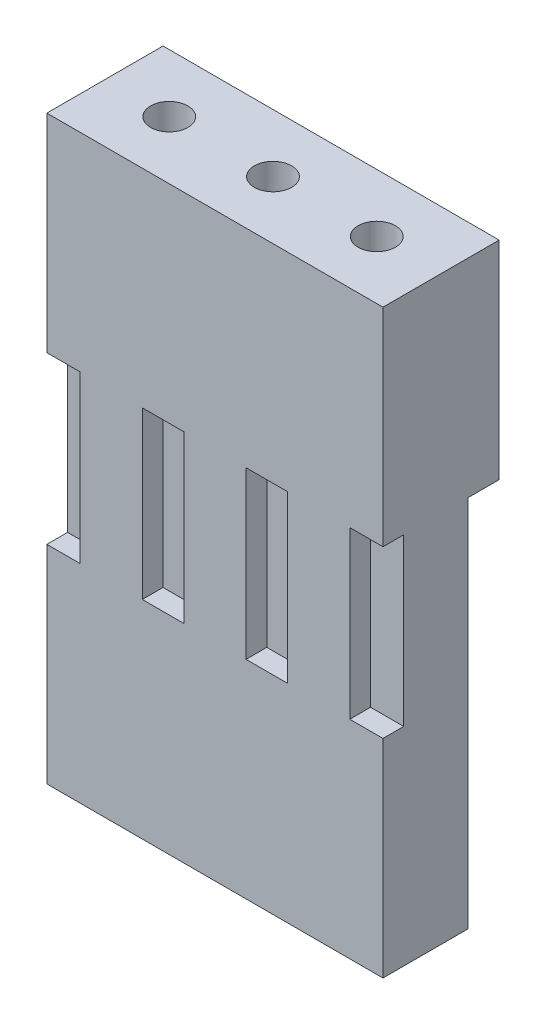
ISO-10303-21;
HEADER;
FILE_DESCRIPTION(('STEP AP214'),'2;1');
FILE_NAME('part.step','',(''),(''),'','','');
FILE_SCHEMA(('AUTOMOTIVE_DESIGN { 1 0 10303 214 1 1 1 1 }'));
ENDSEC;
DATA;
#1=APPLICATION_CONTEXT('core data for automotive mechanical design processes');
#2=APPLICATION_PROTOCOL_DEFINITION('international standard','automotive_design',2000,#1);
#3=PRODUCT_CONTEXT('',#1,'mechanical');
#4=PRODUCT('Part','Part','',(#3));
#5=PRODUCT_RELATED_PRODUCT_CATEGORY('part','',(#4));
#6=PRODUCT_DEFINITION_FORMATION('','',#4);
#7=PRODUCT_DEFINITION_CONTEXT('part definition',#1,'design');
#8=PRODUCT_DEFINITION('design','',#6,#7);
#9=PRODUCT_DEFINITION_SHAPE('','',#8);
#10=(LENGTH_UNIT() NAMED_UNIT(*) SI_UNIT(.MILLI.,.METRE.));
#11=(NAMED_UNIT(*) PLANE_ANGLE_UNIT() SI_UNIT($,.RADIAN.));
#12=(NAMED_UNIT(*) SI_UNIT($,.STERADIAN.) SOLID_ANGLE_UNIT());
#13=UNCERTAINTY_MEASURE_WITH_UNIT(LENGTH_MEASURE(1.E-05),#10,'distance_accuracy_value','');
#14=(GEOMETRIC_REPRESENTATION_CONTEXT(3) GLOBAL_UNCERTAINTY_ASSIGNED_CONTEXT((#13)) GLOBAL_UNIT_ASSIGNED_CONTEXT((#10,
#11,#12)) REPRESENTATION_CONTEXT('',''));
#15=CARTESIAN_POINT('',(0.,0.,0.));
#16=DIRECTION('',(0.,0.,1.));
#17=DIRECTION('',(1.,0.,0.));
#18=AXIS2_PLACEMENT_3D('',#15,#16,#17);
#19=CARTESIAN_POINT('',(0.,-5.,0.));
#20=DIRECTION('',(0.,1.,0.));
#21=DIRECTION('',(0.,0.,1.));
#22=AXIS2_PLACEMENT_3D('',#19,#20,#21);
#23=PLANE('',#22);
#24=DIRECTION('',(0.707106781186553,0.,0.707106781186542));
#25=VECTOR('',#24,1.);
#26=CARTESIAN_POINT('',(4.05,-5.,-0.650000000000012));
#27=LINE('',#26,#25);
#28=CARTESIAN_POINT('',(3.3,-5.,-1.4));
#29=VERTEX_POINT('',#28);
#30=CARTESIAN_POINT('',(4.05,-5.,-0.650000000000012));
#31=VERTEX_POINT('',#30);
#32=EDGE_CURVE('E320',#29,#31,#27,.T.);
#33=ORIENTED_EDGE('',*,*,#32,.F.);
#34=DIRECTION('',(-1.,0.,0.));
#35=VECTOR('',#34,1.);
#36=CARTESIAN_POINT('',(-4.05,-5.,-1.4));
#37=LINE('',#36,#35);
#38=CARTESIAN_POINT('',(4.05,-5.,-1.4));
#39=VERTEX_POINT('',#38);
#40=EDGE_CURVE('E731',#39,#29,#37,.T.);
#41=ORIENTED_EDGE('',*,*,#40,.F.);
#42=DIRECTION('',(0.,0.,-1.));
#43=VECTOR('',#42,1.);
#44=CARTESIAN_POINT('',(4.05,-5.,-1.4));
#45=LINE('',#44,#43);
#46=EDGE_CURVE('E340',#31,#39,#45,.T.);
#47=ORIENTED_EDGE('',*,*,#46,.F.);
#48=EDGE_LOOP('',(#33,#41,#47));
#49=FACE_BOUND('',#48,.T.);
#50=ADVANCED_FACE('F33',(#49),#23,.F.);
#51=DIRECTION('',(0.707106781186552,0.,-0.707106781186543));
#52=VECTOR('',#51,1.);
#53=CARTESIAN_POINT('',(-4.05,-5.,-0.65000000000001));
#54=LINE('',#53,#52);
#55=CARTESIAN_POINT('',(-4.05,-5.,-0.65000000000001));
#56=VERTEX_POINT('',#55);
#57=CARTESIAN_POINT('',(-3.3,-5.,-1.4));
#58=VERTEX_POINT('',#57);
#59=EDGE_CURVE('E315',#56,#58,#54,.T.);
#60=ORIENTED_EDGE('',*,*,#59,.F.);
#61=DIRECTION('',(0.,0.,1.));
#62=VECTOR('',#61,1.);
#63=CARTESIAN_POINT('',(-4.05,-5.,-1.4));
#64=LINE('',#63,#62);
#65=CARTESIAN_POINT('',(-4.05,-5.,-1.4));
#66=VERTEX_POINT('',#65);
#67=EDGE_CURVE('E724',#66,#56,#64,.T.);
#68=ORIENTED_EDGE('',*,*,#67,.F.);
#69=EDGE_CURVE('E733',#58,#66,#37,.T.);
#70=ORIENTED_EDGE('',*,*,#69,.F.);
#71=EDGE_LOOP('',(#60,#68,#70));
#72=FACE_BOUND('',#71,.T.);
#73=ADVANCED_FACE('F407',(#72),#23,.F.);
#74=CARTESIAN_POINT('',(-4.05,-5.,-1.4));
#75=DIRECTION('',(-1.,0.,0.));
#76=DIRECTION('',(0.,0.,1.));
#77=AXIS2_PLACEMENT_3D('',#74,#75,#76);
#78=PLANE('',#77);
#79=DIRECTION('',(0.,0.,-1.));
#80=VECTOR('',#79,1.);
#81=CARTESIAN_POINT('',(-4.05,-5.,-1.4));
#82=LINE('',#81,#80);
#83=CARTESIAN_POINT('',(-4.05,-5.,1.4));
#84=VERTEX_POINT('',#83);
#85=CARTESIAN_POINT('',(-4.05,-5.,0.9));
#86=VERTEX_POINT('',#85);
#87=EDGE_CURVE('E282',#84,#86,#82,.T.);
#88=ORIENTED_EDGE('',*,*,#87,.F.);
#89=DIRECTION('',(0.,1.,0.));
#90=VECTOR('',#89,1.);
#91=CARTESIAN_POINT('',(-4.05,-5.,1.4));
#92=LINE('',#91,#90);
#93=CARTESIAN_POINT('',(-4.05,0.,1.4));
#94=VERTEX_POINT('',#93);
#95=EDGE_CURVE('E386',#84,#94,#92,.T.);
#96=ORIENTED_EDGE('',*,*,#95,.T.);
#97=DIRECTION('',(0.,0.,1.));
#98=VECTOR('',#97,1.);
#99=CARTESIAN_POINT('',(-4.05,0.,-1.4));
#100=LINE('',#99,#98);
#101=CARTESIAN_POINT('',(-4.05,0.,-1.4));
#102=VERTEX_POINT('',#101);
#103=EDGE_CURVE('E711',#102,#94,#100,.T.);
#104=ORIENTED_EDGE('',*,*,#103,.F.);
#105=DIRECTION('',(0.,1.,0.));
#106=VECTOR('',#105,1.);
#107=CARTESIAN_POINT('',(-4.05,-5.,-1.4));
#108=LINE('',#107,#106);
#109=EDGE_CURVE('E368',#66,#102,#108,.T.);
#110=ORIENTED_EDGE('',*,*,#109,.F.);
#111=ORIENTED_EDGE('',*,*,#67,.T.);
#112=DIRECTION('',(0.,1.,0.));
#113=VECTOR('',#112,1.);
#114=CARTESIAN_POINT('',(-4.05,-14.,-0.65000000000001));
#115=LINE('',#114,#113);
#116=CARTESIAN_POINT('',(-4.05,-14.,-0.65000000000001));
#117=VERTEX_POINT('',#116);
#118=EDGE_CURVE('E346',#117,#56,#115,.T.);
#119=ORIENTED_EDGE('',*,*,#118,.F.);
#120=DIRECTION('',(0.,0.,-1.));
#121=VECTOR('',#120,1.);
#122=CARTESIAN_POINT('',(-4.05,-14.,1.4));
#123=LINE('',#122,#121);
#124=CARTESIAN_POINT('',(-4.05,-14.,1.4));
#125=VERTEX_POINT('',#124);
#126=EDGE_CURVE('E319',#125,#117,#123,.T.);
#127=ORIENTED_EDGE('',*,*,#126,.F.);
#128=CARTESIAN_POINT('',(-4.05,-9.,1.4));
#129=VERTEX_POINT('',#128);
#130=EDGE_CURVE('E729',#125,#129,#92,.T.);
#131=ORIENTED_EDGE('',*,*,#130,.T.);
#132=DIRECTION('',(0.,0.,1.));
#133=VECTOR('',#132,1.);
#134=CARTESIAN_POINT('',(-4.05,-9.,-1.4));
#135=LINE('',#134,#133);
#136=CARTESIAN_POINT('',(-4.05,-9.,0.9));
#137=VERTEX_POINT('',#136);
#138=EDGE_CURVE('E278',#137,#129,#135,.T.);
#139=ORIENTED_EDGE('',*,*,#138,.F.);
#140=DIRECTION('',(0.,1.,0.));
#141=VECTOR('',#140,1.);
#142=CARTESIAN_POINT('',(-4.05,-5.,0.9));
#143=LINE('',#142,#141);
#144=EDGE_CURVE('E11',#137,#86,#143,.T.);
#145=ORIENTED_EDGE('',*,*,#144,.T.);
#146=EDGE_LOOP('',(#88,#96,#104,#110,#111,#119,#127,#131,#139,#145));
#147=FACE_BOUND('',#146,.T.);
#148=ADVANCED_FACE('F35',(#147),#78,.T.);
#149=CARTESIAN_POINT('',(-4.05,-5.,-1.4));
#150=DIRECTION('',(0.,0.,-1.));
#151=DIRECTION('',(-1.,0.,0.));
#152=AXIS2_PLACEMENT_3D('',#149,#150,#151);
#153=PLANE('',#152);
#154=DIRECTION('',(-1.,0.,0.));
#155=VECTOR('',#154,1.);
#156=CARTESIAN_POINT('',(-4.05,0.,-1.4));
#157=LINE('',#156,#155);
#158=CARTESIAN_POINT('',(4.05,0.,-1.4));
#159=VERTEX_POINT('',#158);
#160=EDGE_CURVE('E728',#159,#102,#157,.T.);
#161=ORIENTED_EDGE('',*,*,#160,.F.);
#162=DIRECTION('',(0.,1.,0.));
#163=VECTOR('',#162,1.);
#164=CARTESIAN_POINT('',(4.05,-5.,-1.4));
#165=LINE('',#164,#163);
#166=EDGE_CURVE('E745',#39,#159,#165,.T.);
#167=ORIENTED_EDGE('',*,*,#166,.F.);
#168=ORIENTED_EDGE('',*,*,#40,.T.);
#169=DIRECTION('',(0.,1.,0.));
#170=VECTOR('',#169,1.);
#171=CARTESIAN_POINT('',(3.3,-14.,-1.4));
#172=LINE('',#171,#170);
#173=CARTESIAN_POINT('',(3.3,-14.,-1.4));
#174=VERTEX_POINT('',#173);
#175=EDGE_CURVE('E347',#174,#29,#172,.T.);
#176=ORIENTED_EDGE('',*,*,#175,.F.);
#177=DIRECTION('',(1.,0.,0.));
#178=VECTOR('',#177,1.);
#179=CARTESIAN_POINT('',(-3.3,-14.,-1.4));
#180=LINE('',#179,#178);
#181=CARTESIAN_POINT('',(-3.3,-14.,-1.4));
#182=VERTEX_POINT('',#181);
#183=EDGE_CURVE('E324',#182,#174,#180,.T.);
#184=ORIENTED_EDGE('',*,*,#183,.F.);
#185=DIRECTION('',(0.,1.,0.));
#186=VECTOR('',#185,1.);
#187=CARTESIAN_POINT('',(-3.3,-14.,-1.4));
#188=LINE('',#187,#186);
#189=EDGE_CURVE('E343',#182,#58,#188,.T.);
#190=ORIENTED_EDGE('',*,*,#189,.T.);
#191=ORIENTED_EDGE('',*,*,#69,.T.);
#192=ORIENTED_EDGE('',*,*,#109,.T.);
#193=EDGE_LOOP('',(#161,#167,#168,#176,#184,#190,#191,#192));
#194=FACE_BOUND('',#193,.T.);
#195=ADVANCED_FACE('F422',(#194),#153,.T.);
#196=CARTESIAN_POINT('',(4.05,-5.,-1.4));
#197=DIRECTION('',(1.,0.,0.));
#198=DIRECTION('',(0.,0.,-1.));
#199=AXIS2_PLACEMENT_3D('',#196,#197,#198);
#200=PLANE('',#199);
#201=DIRECTION('',(0.,0.,1.));
#202=VECTOR('',#201,1.);
#203=CARTESIAN_POINT('',(4.05,-5.,-1.4));
#204=LINE('',#203,#202);
#205=CARTESIAN_POINT('',(4.05,-5.,0.9));
#206=VERTEX_POINT('',#205);
#207=CARTESIAN_POINT('',(4.05,-5.,1.4));
#208=VERTEX_POINT('',#207);
#209=EDGE_CURVE('E304',#206,#208,#204,.T.);
#210=ORIENTED_EDGE('',*,*,#209,.F.);
#211=DIRECTION('',(0.,-1.,0.));
#212=VECTOR('',#211,1.);
#213=CARTESIAN_POINT('',(4.05,-5.,0.9));
#214=LINE('',#213,#212);
#215=CARTESIAN_POINT('',(4.05,-9.,0.9));
#216=VERTEX_POINT('',#215);
#217=EDGE_CURVE('E367',#206,#216,#214,.T.);
#218=ORIENTED_EDGE('',*,*,#217,.T.);
#219=DIRECTION('',(0.,0.,-1.));
#220=VECTOR('',#219,1.);
#221=CARTESIAN_POINT('',(4.05,-9.,-1.4));
#222=LINE('',#221,#220);
#223=CARTESIAN_POINT('',(4.05,-9.,1.4));
#224=VERTEX_POINT('',#223);
#225=EDGE_CURVE('E300',#224,#216,#222,.T.);
#226=ORIENTED_EDGE('',*,*,#225,.F.);
#227=DIRECTION('',(0.,1.,0.));
#228=VECTOR('',#227,1.);
#229=CARTESIAN_POINT('',(4.05,-5.,1.4));
#230=LINE('',#229,#228);
#231=CARTESIAN_POINT('',(4.05,-14.,1.4));
#232=VERTEX_POINT('',#231);
#233=EDGE_CURVE('E746',#232,#224,#230,.T.);
#234=ORIENTED_EDGE('',*,*,#233,.F.);
#235=DIRECTION('',(0.,0.,1.));
#236=VECTOR('',#235,1.);
#237=CARTESIAN_POINT('',(4.05,-14.,-0.650000000000012));
#238=LINE('',#237,#236);
#239=CARTESIAN_POINT('',(4.05,-14.,-0.650000000000012));
#240=VERTEX_POINT('',#239);
#241=EDGE_CURVE('E328',#240,#232,#238,.T.);
#242=ORIENTED_EDGE('',*,*,#241,.F.);
#243=DIRECTION('',(0.,1.,0.));
#244=VECTOR('',#243,1.);
#245=CARTESIAN_POINT('',(4.05,-14.,-0.650000000000012));
#246=LINE('',#245,#244);
#247=EDGE_CURVE('E331',#240,#31,#246,.T.);
#248=ORIENTED_EDGE('',*,*,#247,.T.);
#249=ORIENTED_EDGE('',*,*,#46,.T.);
#250=ORIENTED_EDGE('',*,*,#166,.T.);
#251=DIRECTION('',(0.,0.,-1.));
#252=VECTOR('',#251,1.);
#253=CARTESIAN_POINT('',(4.05,0.,-1.4));
#254=LINE('',#253,#252);
#255=CARTESIAN_POINT('',(4.05,0.,1.4));
#256=VERTEX_POINT('',#255);
#257=EDGE_CURVE('E739',#256,#159,#254,.T.);
#258=ORIENTED_EDGE('',*,*,#257,.F.);
#259=EDGE_CURVE('E748',#208,#256,#230,.T.);
#260=ORIENTED_EDGE('',*,*,#259,.F.);
#261=EDGE_LOOP('',(#210,#218,#226,#234,#242,#248,#249,#250,#258,#260));
#262=FACE_BOUND('',#261,.T.);
#263=ADVANCED_FACE('F425',(#262),#200,.T.);
#264=CARTESIAN_POINT('',(-4.05,-5.,1.4));
#265=DIRECTION('',(0.,0.,1.));
#266=DIRECTION('',(1.,0.,0.));
#267=AXIS2_PLACEMENT_3D('',#264,#265,#266);
#268=PLANE('',#267);
#269=DIRECTION('',(-1.,0.,0.));
#270=VECTOR('',#269,1.);
#271=CARTESIAN_POINT('',(-0.749999999999999,-5.,1.4));
#272=LINE('',#271,#270);
#273=CARTESIAN_POINT('',(-0.749999999999999,-5.,1.4));
#274=VERTEX_POINT('',#273);
#275=CARTESIAN_POINT('',(-1.75,-5.,1.4));
#276=VERTEX_POINT('',#275);
#277=EDGE_CURVE('E48',#274,#276,#272,.T.);
#278=ORIENTED_EDGE('',*,*,#277,.F.);
#279=DIRECTION('',(0.,1.,0.));
#280=VECTOR('',#279,1.);
#281=CARTESIAN_POINT('',(-0.749999999999999,-5.,1.4));
#282=LINE('',#281,#280);
#283=CARTESIAN_POINT('',(-0.749999999999999,-9.,1.4));
#284=VERTEX_POINT('',#283);
#285=EDGE_CURVE('E214',#284,#274,#282,.T.);
#286=ORIENTED_EDGE('',*,*,#285,.F.);
#287=DIRECTION('',(1.,0.,0.));
#288=VECTOR('',#287,1.);
#289=CARTESIAN_POINT('',(-0.749999999999999,-9.,1.4));
#290=LINE('',#289,#288);
#291=CARTESIAN_POINT('',(-1.75,-9.,1.4));
#292=VERTEX_POINT('',#291);
#293=EDGE_CURVE('E217',#292,#284,#290,.T.);
#294=ORIENTED_EDGE('',*,*,#293,.F.);
#295=DIRECTION('',(0.,-1.,0.));
#296=VECTOR('',#295,1.);
#297=CARTESIAN_POINT('',(-1.75,-5.,1.4));
#298=LINE('',#297,#296);
#299=EDGE_CURVE('E223',#276,#292,#298,.T.);
#300=ORIENTED_EDGE('',*,*,#299,.F.);
#301=EDGE_LOOP('',(#278,#286,#294,#300));
#302=FACE_BOUND('',#301,.T.);
#303=DIRECTION('',(0.,-1.,0.));
#304=VECTOR('',#303,1.);
#305=CARTESIAN_POINT('',(0.750000000000001,-5.,1.4));
#306=LINE('',#305,#304);
#307=CARTESIAN_POINT('',(0.750000000000001,-5.,1.4));
#308=VERTEX_POINT('',#307);
#309=CARTESIAN_POINT('',(0.750000000000001,-9.,1.4));
#310=VERTEX_POINT('',#309);
#311=EDGE_CURVE('E56',#308,#310,#306,.T.);
#312=ORIENTED_EDGE('',*,*,#311,.F.);
#313=DIRECTION('',(-1.,0.,0.));
#314=VECTOR('',#313,1.);
#315=CARTESIAN_POINT('',(0.750000000000001,-5.,1.4));
#316=LINE('',#315,#314);
#317=CARTESIAN_POINT('',(1.75,-5.,1.4));
#318=VERTEX_POINT('',#317);
#319=EDGE_CURVE('E236',#318,#308,#316,.T.);
#320=ORIENTED_EDGE('',*,*,#319,.F.);
#321=DIRECTION('',(0.,1.,0.));
#322=VECTOR('',#321,1.);
#323=CARTESIAN_POINT('',(1.75,-5.,1.4));
#324=LINE('',#323,#322);
#325=CARTESIAN_POINT('',(1.75,-9.,1.4));
#326=VERTEX_POINT('',#325);
#327=EDGE_CURVE('E250',#326,#318,#324,.T.);
#328=ORIENTED_EDGE('',*,*,#327,.F.);
#329=DIRECTION('',(1.,0.,0.));
#330=VECTOR('',#329,1.);
#331=CARTESIAN_POINT('',(0.750000000000001,-9.,1.4));
#332=LINE('',#331,#330);
#333=EDGE_CURVE('E247',#310,#326,#332,.T.);
#334=ORIENTED_EDGE('',*,*,#333,.F.);
#335=EDGE_LOOP('',(#312,#320,#328,#334));
#336=FACE_BOUND('',#335,.T.);
#337=DIRECTION('',(-1.,0.,0.));
#338=VECTOR('',#337,1.);
#339=CARTESIAN_POINT('',(-3.25,-5.,1.4));
#340=LINE('',#339,#338);
#341=CARTESIAN_POINT('',(-3.25,-5.,1.4));
#342=VERTEX_POINT('',#341);
#343=EDGE_CURVE('E257',#342,#84,#340,.T.);
#344=ORIENTED_EDGE('',*,*,#343,.F.);
#345=DIRECTION('',(0.,1.,0.));
#346=VECTOR('',#345,1.);
#347=CARTESIAN_POINT('',(-3.25,-5.,1.4));
#348=LINE('',#347,#346);
#349=CARTESIAN_POINT('',(-3.25,-9.,1.4));
#350=VERTEX_POINT('',#349);
#351=EDGE_CURVE('E267',#350,#342,#348,.T.);
#352=ORIENTED_EDGE('',*,*,#351,.F.);
#353=DIRECTION('',(1.,0.,0.));
#354=VECTOR('',#353,1.);
#355=CARTESIAN_POINT('',(-4.04999999999999,-9.,1.4));
#356=LINE('',#355,#354);
#357=EDGE_CURVE('E41',#129,#350,#356,.T.);
#358=ORIENTED_EDGE('',*,*,#357,.F.);
#359=ORIENTED_EDGE('',*,*,#130,.F.);
#360=DIRECTION('',(-1.,0.,0.));
#361=VECTOR('',#360,1.);
#362=CARTESIAN_POINT('',(4.05,-14.,1.4));
#363=LINE('',#362,#361);
#364=EDGE_CURVE('E316',#232,#125,#363,.T.);
#365=ORIENTED_EDGE('',*,*,#364,.F.);
#366=ORIENTED_EDGE('',*,*,#233,.T.);
#367=DIRECTION('',(1.,0.,0.));
#368=VECTOR('',#367,1.);
#369=CARTESIAN_POINT('',(3.25,-9.,1.4));
#370=LINE('',#369,#368);
#371=CARTESIAN_POINT('',(3.25,-9.,1.4));
#372=VERTEX_POINT('',#371);
#373=EDGE_CURVE('E289',#372,#224,#370,.T.);
#374=ORIENTED_EDGE('',*,*,#373,.F.);
#375=DIRECTION('',(0.,-1.,0.));
#376=VECTOR('',#375,1.);
#377=CARTESIAN_POINT('',(3.25,-5.,1.4));
#378=LINE('',#377,#376);
#379=CARTESIAN_POINT('',(3.25,-5.,1.4));
#380=VERTEX_POINT('',#379);
#381=EDGE_CURVE('E284',#380,#372,#378,.T.);
#382=ORIENTED_EDGE('',*,*,#381,.F.);
#383=DIRECTION('',(-1.,0.,0.));
#384=VECTOR('',#383,1.);
#385=CARTESIAN_POINT('',(-4.05,-5.00000000000001,1.4));
#386=LINE('',#385,#384);
#387=EDGE_CURVE('E365',#208,#380,#386,.T.);
#388=ORIENTED_EDGE('',*,*,#387,.F.);
#389=ORIENTED_EDGE('',*,*,#259,.T.);
#390=DIRECTION('',(1.,0.,0.));
#391=VECTOR('',#390,1.);
#392=CARTESIAN_POINT('',(-4.05,0.,1.4));
#393=LINE('',#392,#391);
#394=EDGE_CURVE('E715',#94,#256,#393,.T.);
#395=ORIENTED_EDGE('',*,*,#394,.F.);
#396=ORIENTED_EDGE('',*,*,#95,.F.);
#397=EDGE_LOOP('',(#344,#352,#358,#359,#365,#366,#374,#382,#388,#389,#395,#396));
#398=FACE_BOUND('',#397,.T.);
#399=ADVANCED_FACE('F383',(#302,#336,#398),#268,.T.);
#400=CARTESIAN_POINT('',(0.,0.,0.));
#401=DIRECTION('',(0.,1.,0.));
#402=DIRECTION('',(0.,0.,1.));
#403=AXIS2_PLACEMENT_3D('',#400,#401,#402);
#404=PLANE('',#403);
#405=CARTESIAN_POINT('',(-2.5,0.,0.));
#406=DIRECTION('',(0.,1.,0.));
#407=DIRECTION('',(0.,0.,-1.));
#408=AXIS2_PLACEMENT_3D('',#405,#406,#407);
#409=CIRCLE('',#408,0.45);
#410=CARTESIAN_POINT('',(-2.5,0.,-0.45));
#411=VERTEX_POINT('',#410);
#412=EDGE_CURVE('E352',#411,#411,#409,.T.);
#413=ORIENTED_EDGE('',*,*,#412,.F.);
#414=EDGE_LOOP('',(#413));
#415=FACE_BOUND('',#414,.T.);
#416=CARTESIAN_POINT('',(0.,0.,0.));
#417=DIRECTION('',(0.,1.,0.));
#418=DIRECTION('',(0.,0.,1.));
#419=AXIS2_PLACEMENT_3D('',#416,#417,#418);
#420=CIRCLE('',#419,0.45);
#421=CARTESIAN_POINT('',(0.,0.,0.45));
#422=VERTEX_POINT('',#421);
#423=EDGE_CURVE('E712',#422,#422,#420,.T.);
#424=ORIENTED_EDGE('',*,*,#423,.F.);
#425=EDGE_LOOP('',(#424));
#426=FACE_BOUND('',#425,.T.);
#427=CARTESIAN_POINT('',(2.5,0.,0.));
#428=DIRECTION('',(0.,1.,0.));
#429=DIRECTION('',(0.,0.,1.));
#430=AXIS2_PLACEMENT_3D('',#427,#428,#429);
#431=CIRCLE('',#430,0.45);
#432=CARTESIAN_POINT('',(2.5,0.,0.45));
#433=VERTEX_POINT('',#432);
#434=EDGE_CURVE('E704',#433,#433,#431,.T.);
#435=ORIENTED_EDGE('',*,*,#434,.F.);
#436=EDGE_LOOP('',(#435));
#437=FACE_BOUND('',#436,.T.);
#438=ORIENTED_EDGE('',*,*,#103,.T.);
#439=ORIENTED_EDGE('',*,*,#394,.T.);
#440=ORIENTED_EDGE('',*,*,#257,.T.);
#441=ORIENTED_EDGE('',*,*,#160,.T.);
#442=EDGE_LOOP('',(#438,#439,#440,#441));
#443=FACE_BOUND('',#442,.T.);
#444=ADVANCED_FACE('F418',(#415,#426,#437,#443),#404,.T.);
#445=CARTESIAN_POINT('',(2.5,-5.,0.));
#446=DIRECTION('',(0.,1.,0.));
#447=DIRECTION('',(0.,0.,1.));
#448=AXIS2_PLACEMENT_3D('',#445,#446,#447);
#449=CYLINDRICAL_SURFACE('',#448,0.45);
#450=ORIENTED_EDGE('',*,*,#434,.T.);
#451=EDGE_LOOP('',(#450));
#452=FACE_BOUND('',#451,.T.);
#453=CARTESIAN_POINT('',(2.5,-14.,0.));
#454=DIRECTION('',(0.,-1.,0.));
#455=DIRECTION('',(0.,0.,-1.));
#456=AXIS2_PLACEMENT_3D('',#453,#454,#455);
#457=CIRCLE('',#456,0.45);
#458=CARTESIAN_POINT('',(2.5,-14.,-0.45));
#459=VERTEX_POINT('',#458);
#460=EDGE_CURVE('E312',#459,#459,#457,.T.);
#461=ORIENTED_EDGE('',*,*,#460,.T.);
#462=EDGE_LOOP('',(#461));
#463=FACE_BOUND('',#462,.T.);
#464=ADVANCED_FACE('F416',(#452,#463),#449,.F.);
#465=CARTESIAN_POINT('',(0.,-5.,0.));
#466=DIRECTION('',(0.,1.,0.));
#467=DIRECTION('',(0.,0.,1.));
#468=AXIS2_PLACEMENT_3D('',#465,#466,#467);
#469=CYLINDRICAL_SURFACE('',#468,0.45);
#470=ORIENTED_EDGE('',*,*,#423,.T.);
#471=EDGE_LOOP('',(#470));
#472=FACE_BOUND('',#471,.T.);
#473=CARTESIAN_POINT('',(0.,-14.,0.));
#474=DIRECTION('',(0.,-1.,0.));
#475=DIRECTION('',(0.,0.,-1.));
#476=AXIS2_PLACEMENT_3D('',#473,#474,#475);
#477=CIRCLE('',#476,0.45);
#478=CARTESIAN_POINT('',(0.,-14.,-0.45));
#479=VERTEX_POINT('',#478);
#480=EDGE_CURVE('E309',#479,#479,#477,.T.);
#481=ORIENTED_EDGE('',*,*,#480,.T.);
#482=EDGE_LOOP('',(#481));
#483=FACE_BOUND('',#482,.T.);
#484=ADVANCED_FACE('F643',(#472,#483),#469,.F.);
#485=CARTESIAN_POINT('',(-2.5,-5.,0.));
#486=DIRECTION('',(0.,1.,0.));
#487=DIRECTION('',(0.,0.,1.));
#488=AXIS2_PLACEMENT_3D('',#485,#486,#487);
#489=CYLINDRICAL_SURFACE('',#488,0.45);
#490=ORIENTED_EDGE('',*,*,#412,.T.);
#491=EDGE_LOOP('',(#490));
#492=FACE_BOUND('',#491,.T.);
#493=CARTESIAN_POINT('',(-2.5,-14.,0.));
#494=DIRECTION('',(0.,-1.,0.));
#495=DIRECTION('',(0.,0.,-1.));
#496=AXIS2_PLACEMENT_3D('',#493,#494,#495);
#497=CIRCLE('',#496,0.45);
#498=CARTESIAN_POINT('',(-2.5,-14.,-0.45));
#499=VERTEX_POINT('',#498);
#500=EDGE_CURVE('E306',#499,#499,#497,.T.);
#501=ORIENTED_EDGE('',*,*,#500,.T.);
#502=EDGE_LOOP('',(#501));
#503=FACE_BOUND('',#502,.T.);
#504=ADVANCED_FACE('F633',(#492,#503),#489,.F.);
#505=CARTESIAN_POINT('',(0.,-14.,0.));
#506=DIRECTION('',(0.,-1.,0.));
#507=DIRECTION('',(0.,0.,-1.));
#508=AXIS2_PLACEMENT_3D('',#505,#506,#507);
#509=PLANE('',#508);
#510=ORIENTED_EDGE('',*,*,#480,.F.);
#511=EDGE_LOOP('',(#510));
#512=FACE_BOUND('',#511,.T.);
#513=ORIENTED_EDGE('',*,*,#364,.T.);
#514=ORIENTED_EDGE('',*,*,#126,.T.);
#515=DIRECTION('',(0.707106781186552,0.,-0.707106781186543));
#516=VECTOR('',#515,1.);
#517=CARTESIAN_POINT('',(-4.05,-14.,-0.65000000000001));
#518=LINE('',#517,#516);
#519=EDGE_CURVE('E322',#117,#182,#518,.T.);
#520=ORIENTED_EDGE('',*,*,#519,.T.);
#521=ORIENTED_EDGE('',*,*,#183,.T.);
#522=DIRECTION('',(0.707106781186553,0.,0.707106781186542));
#523=VECTOR('',#522,1.);
#524=CARTESIAN_POINT('',(4.05,-14.,-0.650000000000012));
#525=LINE('',#524,#523);
#526=EDGE_CURVE('E326',#174,#240,#525,.T.);
#527=ORIENTED_EDGE('',*,*,#526,.T.);
#528=ORIENTED_EDGE('',*,*,#241,.T.);
#529=EDGE_LOOP('',(#513,#514,#520,#521,#527,#528));
#530=FACE_BOUND('',#529,.T.);
#531=ORIENTED_EDGE('',*,*,#460,.F.);
#532=EDGE_LOOP('',(#531));
#533=FACE_BOUND('',#532,.T.);
#534=ORIENTED_EDGE('',*,*,#500,.F.);
#535=EDGE_LOOP('',(#534));
#536=FACE_BOUND('',#535,.T.);
#537=ADVANCED_FACE('F623',(#512,#530,#533,#536),#509,.T.);
#538=CARTESIAN_POINT('',(-4.05,-14.,-0.65000000000001));
#539=DIRECTION('',(0.707106781186543,0.,0.707106781186552));
#540=DIRECTION('',(0.707106781186552,0.,-0.707106781186543));
#541=AXIS2_PLACEMENT_3D('',#538,#539,#540);
#542=PLANE('',#541);
#543=ORIENTED_EDGE('',*,*,#59,.T.);
#544=ORIENTED_EDGE('',*,*,#189,.F.);
#545=ORIENTED_EDGE('',*,*,#519,.F.);
#546=ORIENTED_EDGE('',*,*,#118,.T.);
#547=EDGE_LOOP('',(#543,#544,#545,#546));
#548=FACE_BOUND('',#547,.T.);
#549=ADVANCED_FACE('F613',(#548),#542,.F.);
#550=CARTESIAN_POINT('',(4.05,-14.,-0.650000000000012));
#551=DIRECTION('',(-0.707106781186542,0.,0.707106781186553));
#552=DIRECTION('',(0.707106781186553,0.,0.707106781186542));
#553=AXIS2_PLACEMENT_3D('',#550,#551,#552);
#554=PLANE('',#553);
#555=ORIENTED_EDGE('',*,*,#32,.T.);
#556=ORIENTED_EDGE('',*,*,#247,.F.);
#557=ORIENTED_EDGE('',*,*,#526,.F.);
#558=ORIENTED_EDGE('',*,*,#175,.T.);
#559=EDGE_LOOP('',(#555,#556,#557,#558));
#560=FACE_BOUND('',#559,.T.);
#561=ADVANCED_FACE('F579',(#560),#554,.F.);
#562=CARTESIAN_POINT('',(3.25,-5.,0.9));
#563=DIRECTION('',(-1.,0.,0.));
#564=DIRECTION('',(0.,-1.,0.));
#565=AXIS2_PLACEMENT_3D('',#562,#563,#564);
#566=PLANE('',#565);
#567=ORIENTED_EDGE('',*,*,#381,.T.);
#568=DIRECTION('',(0.,0.,1.));
#569=VECTOR('',#568,1.);
#570=CARTESIAN_POINT('',(3.25,-9.,0.9));
#571=LINE('',#570,#569);
#572=CARTESIAN_POINT('',(3.25,-9.,0.9));
#573=VERTEX_POINT('',#572);
#574=EDGE_CURVE('E294',#573,#372,#571,.T.);
#575=ORIENTED_EDGE('',*,*,#574,.F.);
#576=DIRECTION('',(0.,-1.,0.));
#577=VECTOR('',#576,1.);
#578=CARTESIAN_POINT('',(3.25,-5.,0.9));
#579=LINE('',#578,#577);
#580=CARTESIAN_POINT('',(3.25,-5.,0.9));
#581=VERTEX_POINT('',#580);
#582=EDGE_CURVE('E285',#581,#573,#579,.T.);
#583=ORIENTED_EDGE('',*,*,#582,.F.);
#584=DIRECTION('',(0.,0.,1.));
#585=VECTOR('',#584,1.);
#586=CARTESIAN_POINT('',(3.25,-5.,0.9));
#587=LINE('',#586,#585);
#588=EDGE_CURVE('E297',#581,#380,#587,.T.);
#589=ORIENTED_EDGE('',*,*,#588,.T.);
#590=EDGE_LOOP('',(#567,#575,#583,#589));
#591=FACE_BOUND('',#590,.T.);
#592=ADVANCED_FACE('F570',(#591),#566,.F.);
#593=CARTESIAN_POINT('',(3.25,-5.,0.9));
#594=DIRECTION('',(0.,1.,0.));
#595=DIRECTION('',(-1.,0.,0.));
#596=AXIS2_PLACEMENT_3D('',#593,#594,#595);
#597=PLANE('',#596);
#598=ORIENTED_EDGE('',*,*,#209,.T.);
#599=ORIENTED_EDGE('',*,*,#387,.T.);
#600=ORIENTED_EDGE('',*,*,#588,.F.);
#601=DIRECTION('',(-1.,0.,0.));
#602=VECTOR('',#601,1.);
#603=CARTESIAN_POINT('',(3.25,-5.,0.9));
#604=LINE('',#603,#602);
#605=EDGE_CURVE('E292',#206,#581,#604,.T.);
#606=ORIENTED_EDGE('',*,*,#605,.F.);
#607=EDGE_LOOP('',(#598,#599,#600,#606));
#608=FACE_BOUND('',#607,.T.);
#609=ADVANCED_FACE('F560',(#608),#597,.F.);
#610=CARTESIAN_POINT('',(3.25,-9.,0.9));
#611=DIRECTION('',(0.,-1.,0.));
#612=DIRECTION('',(0.,0.,-1.));
#613=AXIS2_PLACEMENT_3D('',#610,#611,#612);
#614=PLANE('',#613);
#615=ORIENTED_EDGE('',*,*,#225,.T.);
#616=DIRECTION('',(1.,0.,0.));
#617=VECTOR('',#616,1.);
#618=CARTESIAN_POINT('',(3.25,-9.,0.9));
#619=LINE('',#618,#617);
#620=EDGE_CURVE('E288',#573,#216,#619,.T.);
#621=ORIENTED_EDGE('',*,*,#620,.F.);
#622=ORIENTED_EDGE('',*,*,#574,.T.);
#623=ORIENTED_EDGE('',*,*,#373,.T.);
#624=EDGE_LOOP('',(#615,#621,#622,#623));
#625=FACE_BOUND('',#624,.T.);
#626=ADVANCED_FACE('F550',(#625),#614,.F.);
#627=CARTESIAN_POINT('',(0.,0.,0.9));
#628=DIRECTION('',(0.,0.,1.));
#629=DIRECTION('',(1.,0.,0.));
#630=AXIS2_PLACEMENT_3D('',#627,#628,#629);
#631=PLANE('',#630);
#632=ORIENTED_EDGE('',*,*,#605,.T.);
#633=ORIENTED_EDGE('',*,*,#582,.T.);
#634=ORIENTED_EDGE('',*,*,#620,.T.);
#635=ORIENTED_EDGE('',*,*,#217,.F.);
#636=EDGE_LOOP('',(#632,#633,#634,#635));
#637=FACE_BOUND('',#636,.T.);
#638=ADVANCED_FACE('F541',(#637),#631,.T.);
#639=CARTESIAN_POINT('',(-3.25,-5.,0.9));
#640=DIRECTION('',(0.,1.,0.));
#641=DIRECTION('',(-1.,0.,0.));
#642=AXIS2_PLACEMENT_3D('',#639,#640,#641);
#643=PLANE('',#642);
#644=ORIENTED_EDGE('',*,*,#87,.T.);
#645=DIRECTION('',(-1.,0.,0.));
#646=VECTOR('',#645,1.);
#647=CARTESIAN_POINT('',(-3.25,-5.,0.9));
#648=LINE('',#647,#646);
#649=CARTESIAN_POINT('',(-3.25,-5.,0.9));
#650=VERTEX_POINT('',#649);
#651=EDGE_CURVE('E263',#650,#86,#648,.T.);
#652=ORIENTED_EDGE('',*,*,#651,.F.);
#653=DIRECTION('',(0.,0.,1.));
#654=VECTOR('',#653,1.);
#655=CARTESIAN_POINT('',(-3.25,-5.,0.9));
#656=LINE('',#655,#654);
#657=EDGE_CURVE('E276',#650,#342,#656,.T.);
#658=ORIENTED_EDGE('',*,*,#657,.T.);
#659=ORIENTED_EDGE('',*,*,#343,.T.);
#660=EDGE_LOOP('',(#644,#652,#658,#659));
#661=FACE_BOUND('',#660,.T.);
#662=ADVANCED_FACE('F389',(#661),#643,.F.);
#663=CARTESIAN_POINT('',(-3.25,-5.,0.9));
#664=DIRECTION('',(1.,0.,0.));
#665=DIRECTION('',(0.,1.,0.));
#666=AXIS2_PLACEMENT_3D('',#663,#664,#665);
#667=PLANE('',#666);
#668=ORIENTED_EDGE('',*,*,#351,.T.);
#669=ORIENTED_EDGE('',*,*,#657,.F.);
#670=DIRECTION('',(0.,1.,0.));
#671=VECTOR('',#670,1.);
#672=CARTESIAN_POINT('',(-3.25,-5.,0.9));
#673=LINE('',#672,#671);
#674=CARTESIAN_POINT('',(-3.25,-9.,0.9));
#675=VERTEX_POINT('',#674);
#676=EDGE_CURVE('E269',#675,#650,#673,.T.);
#677=ORIENTED_EDGE('',*,*,#676,.F.);
#678=DIRECTION('',(0.,0.,1.));
#679=VECTOR('',#678,1.);
#680=CARTESIAN_POINT('',(-3.25,-9.,0.9));
#681=LINE('',#680,#679);
#682=EDGE_CURVE('E272',#675,#350,#681,.T.);
#683=ORIENTED_EDGE('',*,*,#682,.T.);
#684=EDGE_LOOP('',(#668,#669,#677,#683));
#685=FACE_BOUND('',#684,.T.);
#686=ADVANCED_FACE('F381',(#685),#667,.F.);
#687=CARTESIAN_POINT('',(-3.25,-9.,0.9));
#688=DIRECTION('',(0.,-1.,0.));
#689=DIRECTION('',(1.,0.,0.));
#690=AXIS2_PLACEMENT_3D('',#687,#688,#689);
#691=PLANE('',#690);
#692=ORIENTED_EDGE('',*,*,#138,.T.);
#693=ORIENTED_EDGE('',*,*,#357,.T.);
#694=ORIENTED_EDGE('',*,*,#682,.F.);
#695=DIRECTION('',(1.,0.,0.));
#696=VECTOR('',#695,1.);
#697=CARTESIAN_POINT('',(-3.25,-9.,0.9));
#698=LINE('',#697,#696);
#699=EDGE_CURVE('E266',#137,#675,#698,.T.);
#700=ORIENTED_EDGE('',*,*,#699,.F.);
#701=EDGE_LOOP('',(#692,#693,#694,#700));
#702=FACE_BOUND('',#701,.T.);
#703=ADVANCED_FACE('F373',(#702),#691,.F.);
#704=CARTESIAN_POINT('',(0.,0.,0.9));
#705=DIRECTION('',(0.,0.,1.));
#706=DIRECTION('',(1.,0.,0.));
#707=AXIS2_PLACEMENT_3D('',#704,#705,#706);
#708=PLANE('',#707);
#709=ORIENTED_EDGE('',*,*,#699,.T.);
#710=ORIENTED_EDGE('',*,*,#676,.T.);
#711=ORIENTED_EDGE('',*,*,#651,.T.);
#712=ORIENTED_EDGE('',*,*,#144,.F.);
#713=EDGE_LOOP('',(#709,#710,#711,#712));
#714=FACE_BOUND('',#713,.T.);
#715=ADVANCED_FACE('F394',(#714),#708,.T.);
#716=CARTESIAN_POINT('',(0.750000000000001,-5.,0.9));
#717=DIRECTION('',(-1.,0.,0.));
#718=DIRECTION('',(0.,-1.,0.));
#719=AXIS2_PLACEMENT_3D('',#716,#717,#718);
#720=PLANE('',#719);
#721=ORIENTED_EDGE('',*,*,#311,.T.);
#722=DIRECTION('',(0.,0.,1.));
#723=VECTOR('',#722,1.);
#724=CARTESIAN_POINT('',(0.750000000000001,-9.,0.9));
#725=LINE('',#724,#723);
#726=CARTESIAN_POINT('',(0.750000000000001,-9.,0.9));
#727=VERTEX_POINT('',#726);
#728=EDGE_CURVE('E245',#727,#310,#725,.T.);
#729=ORIENTED_EDGE('',*,*,#728,.F.);
#730=DIRECTION('',(0.,-1.,0.));
#731=VECTOR('',#730,1.);
#732=CARTESIAN_POINT('',(0.750000000000001,-5.,0.9));
#733=LINE('',#732,#731);
#734=CARTESIAN_POINT('',(0.750000000000001,-5.,0.9));
#735=VERTEX_POINT('',#734);
#736=EDGE_CURVE('E232',#735,#727,#733,.T.);
#737=ORIENTED_EDGE('',*,*,#736,.F.);
#738=DIRECTION('',(0.,0.,1.));
#739=VECTOR('',#738,1.);
#740=CARTESIAN_POINT('',(0.750000000000001,-5.,0.9));
#741=LINE('',#740,#739);
#742=EDGE_CURVE('E255',#735,#308,#741,.T.);
#743=ORIENTED_EDGE('',*,*,#742,.T.);
#744=EDGE_LOOP('',(#721,#729,#737,#743));
#745=FACE_BOUND('',#744,.T.);
#746=ADVANCED_FACE('F396',(#745),#720,.F.);
#747=CARTESIAN_POINT('',(0.750000000000001,-5.,0.9));
#748=DIRECTION('',(0.,1.,0.));
#749=DIRECTION('',(0.,0.,1.));
#750=AXIS2_PLACEMENT_3D('',#747,#748,#749);
#751=PLANE('',#750);
#752=ORIENTED_EDGE('',*,*,#319,.T.);
#753=ORIENTED_EDGE('',*,*,#742,.F.);
#754=DIRECTION('',(-1.,0.,0.));
#755=VECTOR('',#754,1.);
#756=CARTESIAN_POINT('',(0.750000000000001,-5.,0.9));
#757=LINE('',#756,#755);
#758=CARTESIAN_POINT('',(1.75,-5.,0.9));
#759=VERTEX_POINT('',#758);
#760=EDGE_CURVE('E242',#759,#735,#757,.T.);
#761=ORIENTED_EDGE('',*,*,#760,.F.);
#762=DIRECTION('',(0.,0.,1.));
#763=VECTOR('',#762,1.);
#764=CARTESIAN_POINT('',(1.75,-5.,0.9));
#765=LINE('',#764,#763);
#766=EDGE_CURVE('E258',#759,#318,#765,.T.);
#767=ORIENTED_EDGE('',*,*,#766,.T.);
#768=EDGE_LOOP('',(#752,#753,#761,#767));
#769=FACE_BOUND('',#768,.T.);
#770=ADVANCED_FACE('F402',(#769),#751,.F.);
#771=CARTESIAN_POINT('',(1.75,-5.,0.9));
#772=DIRECTION('',(1.,0.,0.));
#773=DIRECTION('',(0.,1.,0.));
#774=AXIS2_PLACEMENT_3D('',#771,#772,#773);
#775=PLANE('',#774);
#776=ORIENTED_EDGE('',*,*,#327,.T.);
#777=ORIENTED_EDGE('',*,*,#766,.F.);
#778=DIRECTION('',(0.,1.,0.));
#779=VECTOR('',#778,1.);
#780=CARTESIAN_POINT('',(1.75,-5.,0.9));
#781=LINE('',#780,#779);
#782=CARTESIAN_POINT('',(1.75,-9.,0.9));
#783=VERTEX_POINT('',#782);
#784=EDGE_CURVE('E239',#783,#759,#781,.T.);
#785=ORIENTED_EDGE('',*,*,#784,.F.);
#786=DIRECTION('',(0.,0.,1.));
#787=VECTOR('',#786,1.);
#788=CARTESIAN_POINT('',(1.75,-9.,0.9));
#789=LINE('',#788,#787);
#790=EDGE_CURVE('E260',#783,#326,#789,.T.);
#791=ORIENTED_EDGE('',*,*,#790,.T.);
#792=EDGE_LOOP('',(#776,#777,#785,#791));
#793=FACE_BOUND('',#792,.T.);
#794=ADVANCED_FACE('F448',(#793),#775,.F.);
#795=CARTESIAN_POINT('',(0.750000000000001,-9.,0.9));
#796=DIRECTION('',(0.,-1.,0.));
#797=DIRECTION('',(0.,0.,-1.));
#798=AXIS2_PLACEMENT_3D('',#795,#796,#797);
#799=PLANE('',#798);
#800=ORIENTED_EDGE('',*,*,#333,.T.);
#801=ORIENTED_EDGE('',*,*,#790,.F.);
#802=DIRECTION('',(1.,0.,0.));
#803=VECTOR('',#802,1.);
#804=CARTESIAN_POINT('',(0.750000000000001,-9.,0.9));
#805=LINE('',#804,#803);
#806=EDGE_CURVE('E235',#727,#783,#805,.T.);
#807=ORIENTED_EDGE('',*,*,#806,.F.);
#808=ORIENTED_EDGE('',*,*,#728,.T.);
#809=EDGE_LOOP('',(#800,#801,#807,#808));
#810=FACE_BOUND('',#809,.T.);
#811=ADVANCED_FACE('F439',(#810),#799,.F.);
#812=CARTESIAN_POINT('',(0.,0.,0.9));
#813=DIRECTION('',(0.,0.,1.));
#814=DIRECTION('',(1.,0.,0.));
#815=AXIS2_PLACEMENT_3D('',#812,#813,#814);
#816=PLANE('',#815);
#817=ORIENTED_EDGE('',*,*,#736,.T.);
#818=ORIENTED_EDGE('',*,*,#806,.T.);
#819=ORIENTED_EDGE('',*,*,#784,.T.);
#820=ORIENTED_EDGE('',*,*,#760,.T.);
#821=EDGE_LOOP('',(#817,#818,#819,#820));
#822=FACE_BOUND('',#821,.T.);
#823=ADVANCED_FACE('F445',(#822),#816,.T.);
#824=CARTESIAN_POINT('',(-0.749999999999999,-5.,0.9));
#825=DIRECTION('',(0.,1.,0.));
#826=DIRECTION('',(0.,0.,1.));
#827=AXIS2_PLACEMENT_3D('',#824,#825,#826);
#828=PLANE('',#827);
#829=ORIENTED_EDGE('',*,*,#277,.T.);
#830=DIRECTION('',(0.,0.,1.));
#831=VECTOR('',#830,1.);
#832=CARTESIAN_POINT('',(-1.75,-5.,0.9));
#833=LINE('',#832,#831);
#834=CARTESIAN_POINT('',(-1.75,-5.,0.9));
#835=VERTEX_POINT('',#834);
#836=EDGE_CURVE('E192',#835,#276,#833,.T.);
#837=ORIENTED_EDGE('',*,*,#836,.F.);
#838=DIRECTION('',(-1.,0.,0.));
#839=VECTOR('',#838,1.);
#840=CARTESIAN_POINT('',(-0.749999999999999,-5.,0.9));
#841=LINE('',#840,#839);
#842=CARTESIAN_POINT('',(-0.749999999999999,-5.,0.9));
#843=VERTEX_POINT('',#842);
#844=EDGE_CURVE('E196',#843,#835,#841,.T.);
#845=ORIENTED_EDGE('',*,*,#844,.F.);
#846=DIRECTION('',(0.,0.,1.));
#847=VECTOR('',#846,1.);
#848=CARTESIAN_POINT('',(-0.749999999999999,-5.,0.9));
#849=LINE('',#848,#847);
#850=EDGE_CURVE('E227',#843,#274,#849,.T.);
#851=ORIENTED_EDGE('',*,*,#850,.T.);
#852=EDGE_LOOP('',(#829,#837,#845,#851));
#853=FACE_BOUND('',#852,.T.);
#854=ADVANCED_FACE('F194',(#853),#828,.F.);
#855=CARTESIAN_POINT('',(-0.749999999999999,-5.,0.9));
#856=DIRECTION('',(1.,0.,0.));
#857=DIRECTION('',(0.,1.,0.));
#858=AXIS2_PLACEMENT_3D('',#855,#856,#857);
#859=PLANE('',#858);
#860=ORIENTED_EDGE('',*,*,#285,.T.);
#861=ORIENTED_EDGE('',*,*,#850,.F.);
#862=DIRECTION('',(0.,1.,0.));
#863=VECTOR('',#862,1.);
#864=CARTESIAN_POINT('',(-0.749999999999999,-5.,0.9));
#865=LINE('',#864,#863);
#866=CARTESIAN_POINT('',(-0.749999999999999,-9.,0.9));
#867=VERTEX_POINT('',#866);
#868=EDGE_CURVE('E202',#867,#843,#865,.T.);
#869=ORIENTED_EDGE('',*,*,#868,.F.);
#870=DIRECTION('',(0.,0.,1.));
#871=VECTOR('',#870,1.);
#872=CARTESIAN_POINT('',(-0.749999999999999,-9.,0.9));
#873=LINE('',#872,#871);
#874=EDGE_CURVE('E229',#867,#284,#873,.T.);
#875=ORIENTED_EDGE('',*,*,#874,.T.);
#876=EDGE_LOOP('',(#860,#861,#869,#875));
#877=FACE_BOUND('',#876,.T.);
#878=ADVANCED_FACE('F462',(#877),#859,.F.);
#879=CARTESIAN_POINT('',(-0.749999999999999,-9.,0.9));
#880=DIRECTION('',(0.,-1.,0.));
#881=DIRECTION('',(0.,0.,-1.));
#882=AXIS2_PLACEMENT_3D('',#879,#880,#881);
#883=PLANE('',#882);
#884=ORIENTED_EDGE('',*,*,#293,.T.);
#885=ORIENTED_EDGE('',*,*,#874,.F.);
#886=DIRECTION('',(1.,0.,0.));
#887=VECTOR('',#886,1.);
#888=CARTESIAN_POINT('',(-0.749999999999999,-9.,0.9));
#889=LINE('',#888,#887);
#890=CARTESIAN_POINT('',(-1.75,-9.,0.9));
#891=VERTEX_POINT('',#890);
#892=EDGE_CURVE('E210',#891,#867,#889,.T.);
#893=ORIENTED_EDGE('',*,*,#892,.F.);
#894=DIRECTION('',(0.,0.,1.));
#895=VECTOR('',#894,1.);
#896=CARTESIAN_POINT('',(-1.75,-9.,0.9));
#897=LINE('',#896,#895);
#898=EDGE_CURVE('E201',#891,#292,#897,.T.);
#899=ORIENTED_EDGE('',*,*,#898,.T.);
#900=EDGE_LOOP('',(#884,#885,#893,#899));
#901=FACE_BOUND('',#900,.T.);
#902=ADVANCED_FACE('F465',(#901),#883,.F.);
#903=CARTESIAN_POINT('',(-1.75,-5.,0.9));
#904=DIRECTION('',(-1.,0.,0.));
#905=DIRECTION('',(0.,-1.,0.));
#906=AXIS2_PLACEMENT_3D('',#903,#904,#905);
#907=PLANE('',#906);
#908=ORIENTED_EDGE('',*,*,#299,.T.);
#909=ORIENTED_EDGE('',*,*,#898,.F.);
#910=DIRECTION('',(0.,-1.,0.));
#911=VECTOR('',#910,1.);
#912=CARTESIAN_POINT('',(-1.75,-5.,0.9));
#913=LINE('',#912,#911);
#914=EDGE_CURVE('E205',#835,#891,#913,.T.);
#915=ORIENTED_EDGE('',*,*,#914,.F.);
#916=ORIENTED_EDGE('',*,*,#836,.T.);
#917=EDGE_LOOP('',(#908,#909,#915,#916));
#918=FACE_BOUND('',#917,.T.);
#919=ADVANCED_FACE('F206',(#918),#907,.F.);
#920=CARTESIAN_POINT('',(0.,0.,0.9));
#921=DIRECTION('',(0.,0.,1.));
#922=DIRECTION('',(1.,0.,0.));
#923=AXIS2_PLACEMENT_3D('',#920,#921,#922);
#924=PLANE('',#923);
#925=ORIENTED_EDGE('',*,*,#844,.T.);
#926=ORIENTED_EDGE('',*,*,#914,.T.);
#927=ORIENTED_EDGE('',*,*,#892,.T.);
#928=ORIENTED_EDGE('',*,*,#868,.T.);
#929=EDGE_LOOP('',(#925,#926,#927,#928));
#930=FACE_BOUND('',#929,.T.);
#931=ADVANCED_FACE('F212',(#930),#924,.T.);
#932=CLOSED_SHELL('',(#50,#73,#148,#195,#263,#399,#444,#464,#484,#504,#537,#549,#561,#592,#609,
#626,#638,#662,#686,#703,#715,#746,#770,#794,#811,#823,#854,#878,#902,#919,#931));
#933=MANIFOLD_SOLID_BREP('B2',#932);
#934=ADVANCED_BREP_SHAPE_REPRESENTATION('',(#18,#933),#14);
#935=SHAPE_DEFINITION_REPRESENTATION(#9,#934);
ENDSEC;
END-ISO-10303-21;
